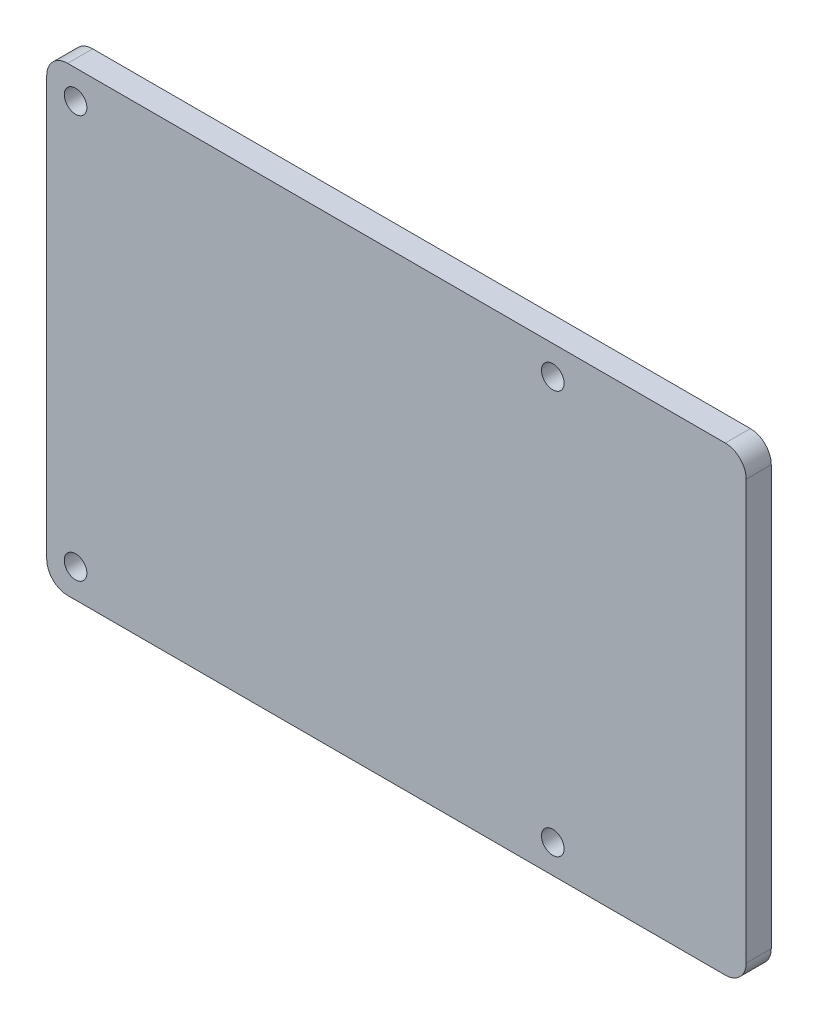
ISO-10303-21;
HEADER;
FILE_DESCRIPTION(('STEP AP214'),'2;1');
FILE_NAME('part.step','',(''),(''),'','','');
FILE_SCHEMA(('AUTOMOTIVE_DESIGN { 1 0 10303 214 1 1 1 1 }'));
ENDSEC;
DATA;
#1=APPLICATION_CONTEXT('core data for automotive mechanical design processes');
#2=APPLICATION_PROTOCOL_DEFINITION('international standard','automotive_design',2000,#1);
#3=PRODUCT_CONTEXT('',#1,'mechanical');
#4=PRODUCT('Part','Part','',(#3));
#5=PRODUCT_RELATED_PRODUCT_CATEGORY('part','',(#4));
#6=PRODUCT_DEFINITION_FORMATION('','',#4);
#7=PRODUCT_DEFINITION_CONTEXT('part definition',#1,'design');
#8=PRODUCT_DEFINITION('design','',#6,#7);
#9=PRODUCT_DEFINITION_SHAPE('','',#8);
#10=(LENGTH_UNIT() NAMED_UNIT(*) SI_UNIT(.MILLI.,.METRE.));
#11=(NAMED_UNIT(*) PLANE_ANGLE_UNIT() SI_UNIT($,.RADIAN.));
#12=(NAMED_UNIT(*) SI_UNIT($,.STERADIAN.) SOLID_ANGLE_UNIT());
#13=UNCERTAINTY_MEASURE_WITH_UNIT(LENGTH_MEASURE(1.E-05),#10,'distance_accuracy_value','');
#14=(GEOMETRIC_REPRESENTATION_CONTEXT(3) GLOBAL_UNCERTAINTY_ASSIGNED_CONTEXT((#13)) GLOBAL_UNIT_ASSIGNED_CONTEXT((#10,
#11,#12)) REPRESENTATION_CONTEXT('',''));
#15=CARTESIAN_POINT('',(0.,0.,0.));
#16=DIRECTION('',(0.,0.,1.));
#17=DIRECTION('',(1.,0.,0.));
#18=AXIS2_PLACEMENT_3D('',#15,#16,#17);
#19=CARTESIAN_POINT('',(80.3396386598597,12.48963974,-3.048));
#20=DIRECTION('',(0.,0.,1.));
#21=DIRECTION('',(1.,0.,0.));
#22=AXIS2_PLACEMENT_3D('',#19,#20,#21);
#23=CYLINDRICAL_SURFACE('',#22,2.54);
#24=CARTESIAN_POINT('',(80.3396386598597,12.48963974,0.));
#25=DIRECTION('',(0.,0.,1.));
#26=DIRECTION('',(-1.,0.,0.));
#27=AXIS2_PLACEMENT_3D('',#24,#25,#26);
#28=CIRCLE('',#27,2.54);
#29=CARTESIAN_POINT('',(82.8796386598597,12.48963974,0.));
#30=VERTEX_POINT('',#29);
#31=CARTESIAN_POINT('',(80.3396386598597,15.02963974,0.));
#32=VERTEX_POINT('',#31);
#33=EDGE_CURVE('E129',#30,#32,#28,.T.);
#34=ORIENTED_EDGE('',*,*,#33,.F.);
#35=DIRECTION('',(0.,0.,1.));
#36=VECTOR('',#35,1.);
#37=CARTESIAN_POINT('',(82.8796386598597,12.48963974,-3.048));
#38=LINE('',#37,#36);
#39=CARTESIAN_POINT('',(82.8796386598597,12.48963974,-3.048));
#40=VERTEX_POINT('',#39);
#41=EDGE_CURVE('E11',#40,#30,#38,.T.);
#42=ORIENTED_EDGE('',*,*,#41,.F.);
#43=CARTESIAN_POINT('',(80.3396386598597,12.48963974,-3.048));
#44=DIRECTION('',(0.,0.,1.));
#45=DIRECTION('',(-1.,0.,0.));
#46=AXIS2_PLACEMENT_3D('',#43,#44,#45);
#47=CIRCLE('',#46,2.54);
#48=CARTESIAN_POINT('',(80.3396386598597,15.02963974,-3.048));
#49=VERTEX_POINT('',#48);
#50=EDGE_CURVE('E150',#40,#49,#47,.T.);
#51=ORIENTED_EDGE('',*,*,#50,.T.);
#52=DIRECTION('',(0.,0.,1.));
#53=VECTOR('',#52,1.);
#54=CARTESIAN_POINT('',(80.3396386598597,15.02963974,-3.048));
#55=LINE('',#54,#53);
#56=EDGE_CURVE('E35',#49,#32,#55,.T.);
#57=ORIENTED_EDGE('',*,*,#56,.T.);
#58=EDGE_LOOP('',(#34,#42,#51,#57));
#59=FACE_BOUND('',#58,.T.);
#60=ADVANCED_FACE('F32',(#59),#23,.T.);
#61=CARTESIAN_POINT('',(82.8796386598597,12.48963974,-3.048));
#62=DIRECTION('',(1.,0.,0.));
#63=DIRECTION('',(0.,1.,0.));
#64=AXIS2_PLACEMENT_3D('',#61,#62,#63);
#65=PLANE('',#64);
#66=DIRECTION('',(0.,1.,0.));
#67=VECTOR('',#66,1.);
#68=CARTESIAN_POINT('',(82.8796386598597,12.48963974,0.));
#69=LINE('',#68,#67);
#70=CARTESIAN_POINT('',(82.8796386598597,-38.4396361,0.));
#71=VERTEX_POINT('',#70);
#72=EDGE_CURVE('E148',#71,#30,#69,.T.);
#73=ORIENTED_EDGE('',*,*,#72,.F.);
#74=DIRECTION('',(0.,0.,1.));
#75=VECTOR('',#74,1.);
#76=CARTESIAN_POINT('',(82.8796386598597,-38.4396361,-3.048));
#77=LINE('',#76,#75);
#78=CARTESIAN_POINT('',(82.8796386598597,-38.4396361,-3.048));
#79=VERTEX_POINT('',#78);
#80=EDGE_CURVE('E41',#79,#71,#77,.T.);
#81=ORIENTED_EDGE('',*,*,#80,.F.);
#82=DIRECTION('',(0.,1.,0.));
#83=VECTOR('',#82,1.);
#84=CARTESIAN_POINT('',(82.8796386598597,12.48963974,-3.048));
#85=LINE('',#84,#83);
#86=EDGE_CURVE('E119',#79,#40,#85,.T.);
#87=ORIENTED_EDGE('',*,*,#86,.T.);
#88=ORIENTED_EDGE('',*,*,#41,.T.);
#89=EDGE_LOOP('',(#73,#81,#87,#88));
#90=FACE_BOUND('',#89,.T.);
#91=ADVANCED_FACE('F162',(#90),#65,.T.);
#92=CARTESIAN_POINT('',(80.3396386598597,-38.4396361,-3.048));
#93=DIRECTION('',(0.,0.,1.));
#94=DIRECTION('',(1.,0.,0.));
#95=AXIS2_PLACEMENT_3D('',#92,#93,#94);
#96=CYLINDRICAL_SURFACE('',#95,2.54);
#97=CARTESIAN_POINT('',(80.3396386598597,-38.4396361,0.));
#98=DIRECTION('',(0.,0.,1.));
#99=DIRECTION('',(-1.,0.,0.));
#100=AXIS2_PLACEMENT_3D('',#97,#98,#99);
#101=CIRCLE('',#100,2.54);
#102=CARTESIAN_POINT('',(80.3396386598597,-40.9796361,0.));
#103=VERTEX_POINT('',#102);
#104=EDGE_CURVE('E106',#103,#71,#101,.T.);
#105=ORIENTED_EDGE('',*,*,#104,.F.);
#106=DIRECTION('',(0.,0.,1.));
#107=VECTOR('',#106,1.);
#108=CARTESIAN_POINT('',(80.3396386598597,-40.9796361,-3.048));
#109=LINE('',#108,#107);
#110=CARTESIAN_POINT('',(80.3396386598597,-40.9796361,-3.048));
#111=VERTEX_POINT('',#110);
#112=EDGE_CURVE('E101',#111,#103,#109,.T.);
#113=ORIENTED_EDGE('',*,*,#112,.F.);
#114=CARTESIAN_POINT('',(80.3396386598597,-38.4396361,-3.048));
#115=DIRECTION('',(0.,0.,1.));
#116=DIRECTION('',(-1.,0.,0.));
#117=AXIS2_PLACEMENT_3D('',#114,#115,#116);
#118=CIRCLE('',#117,2.54);
#119=EDGE_CURVE('E104',#111,#79,#118,.T.);
#120=ORIENTED_EDGE('',*,*,#119,.T.);
#121=ORIENTED_EDGE('',*,*,#80,.T.);
#122=EDGE_LOOP('',(#105,#113,#120,#121));
#123=FACE_BOUND('',#122,.T.);
#124=ADVANCED_FACE('F103',(#123),#96,.T.);
#125=CARTESIAN_POINT('',(0.41036367000002,-40.9796361,-3.048));
#126=DIRECTION('',(0.,-1.,0.));
#127=DIRECTION('',(0.,0.,-1.));
#128=AXIS2_PLACEMENT_3D('',#125,#126,#127);
#129=PLANE('',#128);
#130=DIRECTION('',(1.,0.,0.));
#131=VECTOR('',#130,1.);
#132=CARTESIAN_POINT('',(0.41036367000002,-40.9796361,0.));
#133=LINE('',#132,#131);
#134=CARTESIAN_POINT('',(0.410363670000021,-40.9796361,0.));
#135=VERTEX_POINT('',#134);
#136=EDGE_CURVE('E145',#135,#103,#133,.T.);
#137=ORIENTED_EDGE('',*,*,#136,.F.);
#138=DIRECTION('',(0.,0.,1.));
#139=VECTOR('',#138,1.);
#140=CARTESIAN_POINT('',(0.410363670000021,-40.9796361,-3.048));
#141=LINE('',#140,#139);
#142=CARTESIAN_POINT('',(0.410363670000021,-40.9796361,-3.048));
#143=VERTEX_POINT('',#142);
#144=EDGE_CURVE('E111',#143,#135,#141,.T.);
#145=ORIENTED_EDGE('',*,*,#144,.F.);
#146=DIRECTION('',(1.,0.,0.));
#147=VECTOR('',#146,1.);
#148=CARTESIAN_POINT('',(0.41036367000002,-40.9796361,-3.048));
#149=LINE('',#148,#147);
#150=EDGE_CURVE('E117',#143,#111,#149,.T.);
#151=ORIENTED_EDGE('',*,*,#150,.T.);
#152=ORIENTED_EDGE('',*,*,#112,.T.);
#153=EDGE_LOOP('',(#137,#145,#151,#152));
#154=FACE_BOUND('',#153,.T.);
#155=ADVANCED_FACE('F121',(#154),#129,.T.);
#156=CARTESIAN_POINT('',(0.410363670000002,-38.4396361,-3.048));
#157=DIRECTION('',(0.,0.,1.));
#158=DIRECTION('',(1.,0.,0.));
#159=AXIS2_PLACEMENT_3D('',#156,#157,#158);
#160=CYLINDRICAL_SURFACE('',#159,2.54);
#161=CARTESIAN_POINT('',(0.410363670000002,-38.4396361,0.));
#162=DIRECTION('',(0.,0.,1.));
#163=DIRECTION('',(-1.,0.,0.));
#164=AXIS2_PLACEMENT_3D('',#161,#162,#163);
#165=CIRCLE('',#164,2.54);
#166=CARTESIAN_POINT('',(-2.12963633,-38.4396361,0.));
#167=VERTEX_POINT('',#166);
#168=EDGE_CURVE('E142',#167,#135,#165,.T.);
#169=ORIENTED_EDGE('',*,*,#168,.F.);
#170=DIRECTION('',(0.,0.,1.));
#171=VECTOR('',#170,1.);
#172=CARTESIAN_POINT('',(-2.12963633,-38.4396361,-3.048));
#173=LINE('',#172,#171);
#174=CARTESIAN_POINT('',(-2.12963633,-38.4396361,-3.048));
#175=VERTEX_POINT('',#174);
#176=EDGE_CURVE('E154',#175,#167,#173,.T.);
#177=ORIENTED_EDGE('',*,*,#176,.F.);
#178=CARTESIAN_POINT('',(0.410363670000002,-38.4396361,-3.048));
#179=DIRECTION('',(0.,0.,1.));
#180=DIRECTION('',(-1.,0.,0.));
#181=AXIS2_PLACEMENT_3D('',#178,#179,#180);
#182=CIRCLE('',#181,2.54);
#183=EDGE_CURVE('E122',#175,#143,#182,.T.);
#184=ORIENTED_EDGE('',*,*,#183,.T.);
#185=ORIENTED_EDGE('',*,*,#144,.T.);
#186=EDGE_LOOP('',(#169,#177,#184,#185));
#187=FACE_BOUND('',#186,.T.);
#188=ADVANCED_FACE('F175',(#187),#160,.T.);
#189=CARTESIAN_POINT('',(-2.12963633,12.48963974,-3.048));
#190=DIRECTION('',(-1.,0.,0.));
#191=DIRECTION('',(0.,0.,1.));
#192=AXIS2_PLACEMENT_3D('',#189,#190,#191);
#193=PLANE('',#192);
#194=DIRECTION('',(0.,-1.,0.));
#195=VECTOR('',#194,1.);
#196=CARTESIAN_POINT('',(-2.12963633,12.48963974,0.));
#197=LINE('',#196,#195);
#198=CARTESIAN_POINT('',(-2.12963633,12.48963974,0.));
#199=VERTEX_POINT('',#198);
#200=EDGE_CURVE('E139',#199,#167,#197,.T.);
#201=ORIENTED_EDGE('',*,*,#200,.F.);
#202=DIRECTION('',(0.,0.,1.));
#203=VECTOR('',#202,1.);
#204=CARTESIAN_POINT('',(-2.12963633,12.48963974,-3.048));
#205=LINE('',#204,#203);
#206=CARTESIAN_POINT('',(-2.12963633,12.48963974,-3.048));
#207=VERTEX_POINT('',#206);
#208=EDGE_CURVE('E156',#207,#199,#205,.T.);
#209=ORIENTED_EDGE('',*,*,#208,.F.);
#210=DIRECTION('',(0.,-1.,0.));
#211=VECTOR('',#210,1.);
#212=CARTESIAN_POINT('',(-2.12963633,12.48963974,-3.048));
#213=LINE('',#212,#211);
#214=EDGE_CURVE('E124',#207,#175,#213,.T.);
#215=ORIENTED_EDGE('',*,*,#214,.T.);
#216=ORIENTED_EDGE('',*,*,#176,.T.);
#217=EDGE_LOOP('',(#201,#209,#215,#216));
#218=FACE_BOUND('',#217,.T.);
#219=ADVANCED_FACE('F178',(#218),#193,.T.);
#220=CARTESIAN_POINT('',(0.410363670000002,12.48963974,-3.048));
#221=DIRECTION('',(0.,0.,1.));
#222=DIRECTION('',(1.,0.,0.));
#223=AXIS2_PLACEMENT_3D('',#220,#221,#222);
#224=CYLINDRICAL_SURFACE('',#223,2.54);
#225=CARTESIAN_POINT('',(0.410363670000002,12.48963974,0.));
#226=DIRECTION('',(0.,0.,1.));
#227=DIRECTION('',(-1.,0.,0.));
#228=AXIS2_PLACEMENT_3D('',#225,#226,#227);
#229=CIRCLE('',#228,2.54);
#230=CARTESIAN_POINT('',(0.41036367000002,15.02963974,0.));
#231=VERTEX_POINT('',#230);
#232=EDGE_CURVE('E136',#231,#199,#229,.T.);
#233=ORIENTED_EDGE('',*,*,#232,.F.);
#234=DIRECTION('',(0.,0.,1.));
#235=VECTOR('',#234,1.);
#236=CARTESIAN_POINT('',(0.41036367000002,15.02963974,-3.048));
#237=LINE('',#236,#235);
#238=CARTESIAN_POINT('',(0.41036367000002,15.02963974,-3.048));
#239=VERTEX_POINT('',#238);
#240=EDGE_CURVE('E157',#239,#231,#237,.T.);
#241=ORIENTED_EDGE('',*,*,#240,.F.);
#242=CARTESIAN_POINT('',(0.410363670000002,12.48963974,-3.048));
#243=DIRECTION('',(0.,0.,1.));
#244=DIRECTION('',(-1.,0.,0.));
#245=AXIS2_PLACEMENT_3D('',#242,#243,#244);
#246=CIRCLE('',#245,2.54);
#247=EDGE_CURVE('E244',#239,#207,#246,.T.);
#248=ORIENTED_EDGE('',*,*,#247,.T.);
#249=ORIENTED_EDGE('',*,*,#208,.T.);
#250=EDGE_LOOP('',(#233,#241,#248,#249));
#251=FACE_BOUND('',#250,.T.);
#252=ADVANCED_FACE('F182',(#251),#224,.T.);
#253=CARTESIAN_POINT('',(0.41036367000002,15.02963974,-3.048));
#254=DIRECTION('',(0.,1.,0.));
#255=DIRECTION('',(-1.,0.,0.));
#256=AXIS2_PLACEMENT_3D('',#253,#254,#255);
#257=PLANE('',#256);
#258=DIRECTION('',(-1.,0.,0.));
#259=VECTOR('',#258,1.);
#260=CARTESIAN_POINT('',(0.41036367000002,15.02963974,0.));
#261=LINE('',#260,#259);
#262=EDGE_CURVE('E132',#32,#231,#261,.T.);
#263=ORIENTED_EDGE('',*,*,#262,.F.);
#264=ORIENTED_EDGE('',*,*,#56,.F.);
#265=DIRECTION('',(-1.,0.,0.));
#266=VECTOR('',#265,1.);
#267=CARTESIAN_POINT('',(0.41036367000002,15.02963974,-3.048));
#268=LINE('',#267,#266);
#269=EDGE_CURVE('E242',#49,#239,#268,.T.);
#270=ORIENTED_EDGE('',*,*,#269,.T.);
#271=ORIENTED_EDGE('',*,*,#240,.T.);
#272=EDGE_LOOP('',(#263,#264,#270,#271));
#273=FACE_BOUND('',#272,.T.);
#274=ADVANCED_FACE('F159',(#273),#257,.T.);
#275=CARTESIAN_POINT('',(80.3396386598597,12.48963974,-3.048));
#276=DIRECTION('',(0.,0.,-1.));
#277=DIRECTION('',(-1.,0.,0.));
#278=AXIS2_PLACEMENT_3D('',#275,#276,#277);
#279=PLANE('',#278);
#280=CARTESIAN_POINT('',(1.37500106,-37.47499998,-3.048));
#281=DIRECTION('',(0.,0.,1.));
#282=DIRECTION('',(1.,0.,0.));
#283=AXIS2_PLACEMENT_3D('',#280,#281,#282);
#284=CIRCLE('',#283,1.37499852);
#285=CARTESIAN_POINT('',(2.74999958,-37.47499998,-3.048));
#286=VERTEX_POINT('',#285);
#287=EDGE_CURVE('E217',#286,#286,#284,.T.);
#288=ORIENTED_EDGE('',*,*,#287,.T.);
#289=EDGE_LOOP('',(#288));
#290=FACE_BOUND('',#289,.T.);
#291=CARTESIAN_POINT('',(59.3750019,-37.47499998,-3.048));
#292=DIRECTION('',(0.,0.,1.));
#293=DIRECTION('',(1.,0.,0.));
#294=AXIS2_PLACEMENT_3D('',#291,#292,#293);
#295=CIRCLE('',#294,1.37499852);
#296=CARTESIAN_POINT('',(60.75000042,-37.47499998,-3.048));
#297=VERTEX_POINT('',#296);
#298=EDGE_CURVE('E225',#297,#297,#295,.T.);
#299=ORIENTED_EDGE('',*,*,#298,.T.);
#300=EDGE_LOOP('',(#299));
#301=FACE_BOUND('',#300,.T.);
#302=CARTESIAN_POINT('',(59.3750019,11.52500108,-3.048));
#303=DIRECTION('',(0.,0.,1.));
#304=DIRECTION('',(1.,0.,0.));
#305=AXIS2_PLACEMENT_3D('',#302,#303,#304);
#306=CIRCLE('',#305,1.37499852);
#307=CARTESIAN_POINT('',(60.75000042,11.52500108,-3.048));
#308=VERTEX_POINT('',#307);
#309=EDGE_CURVE('E231',#308,#308,#306,.T.);
#310=ORIENTED_EDGE('',*,*,#309,.T.);
#311=EDGE_LOOP('',(#310));
#312=FACE_BOUND('',#311,.T.);
#313=CARTESIAN_POINT('',(1.37500106,11.52500108,-3.048));
#314=DIRECTION('',(0.,0.,1.));
#315=DIRECTION('',(1.,0.,0.));
#316=AXIS2_PLACEMENT_3D('',#313,#314,#315);
#317=CIRCLE('',#316,1.37499852);
#318=CARTESIAN_POINT('',(2.74999958,11.52500108,-3.048));
#319=VERTEX_POINT('',#318);
#320=EDGE_CURVE('E133',#319,#319,#317,.T.);
#321=ORIENTED_EDGE('',*,*,#320,.T.);
#322=EDGE_LOOP('',(#321));
#323=FACE_BOUND('',#322,.T.);
#324=ORIENTED_EDGE('',*,*,#50,.F.);
#325=ORIENTED_EDGE('',*,*,#86,.F.);
#326=ORIENTED_EDGE('',*,*,#119,.F.);
#327=ORIENTED_EDGE('',*,*,#150,.F.);
#328=ORIENTED_EDGE('',*,*,#183,.F.);
#329=ORIENTED_EDGE('',*,*,#214,.F.);
#330=ORIENTED_EDGE('',*,*,#247,.F.);
#331=ORIENTED_EDGE('',*,*,#269,.F.);
#332=EDGE_LOOP('',(#324,#325,#326,#327,#328,#329,#330,#331));
#333=FACE_BOUND('',#332,.T.);
#334=ADVANCED_FACE('F115',(#290,#301,#312,#323,#333),#279,.T.);
#335=CARTESIAN_POINT('',(80.3396386598597,12.48963974,0.));
#336=DIRECTION('',(0.,0.,-1.));
#337=DIRECTION('',(-1.,0.,0.));
#338=AXIS2_PLACEMENT_3D('',#335,#336,#337);
#339=PLANE('',#338);
#340=CARTESIAN_POINT('',(1.37500106,-37.47499998,0.));
#341=DIRECTION('',(0.,0.,1.));
#342=DIRECTION('',(1.,0.,0.));
#343=AXIS2_PLACEMENT_3D('',#340,#341,#342);
#344=CIRCLE('',#343,1.37499852);
#345=CARTESIAN_POINT('',(2.74999958,-37.47499998,0.));
#346=VERTEX_POINT('',#345);
#347=EDGE_CURVE('E220',#346,#346,#344,.T.);
#348=ORIENTED_EDGE('',*,*,#347,.F.);
#349=EDGE_LOOP('',(#348));
#350=FACE_BOUND('',#349,.T.);
#351=CARTESIAN_POINT('',(59.3750019,-37.47499998,0.));
#352=DIRECTION('',(0.,0.,1.));
#353=DIRECTION('',(1.,0.,0.));
#354=AXIS2_PLACEMENT_3D('',#351,#352,#353);
#355=CIRCLE('',#354,1.37499852);
#356=CARTESIAN_POINT('',(60.75000042,-37.47499998,0.));
#357=VERTEX_POINT('',#356);
#358=EDGE_CURVE('E222',#357,#357,#355,.T.);
#359=ORIENTED_EDGE('',*,*,#358,.F.);
#360=EDGE_LOOP('',(#359));
#361=FACE_BOUND('',#360,.T.);
#362=CARTESIAN_POINT('',(59.3750019,11.52500108,0.));
#363=DIRECTION('',(0.,0.,1.));
#364=DIRECTION('',(1.,0.,0.));
#365=AXIS2_PLACEMENT_3D('',#362,#363,#364);
#366=CIRCLE('',#365,1.37499852);
#367=CARTESIAN_POINT('',(60.75000042,11.52500108,0.));
#368=VERTEX_POINT('',#367);
#369=EDGE_CURVE('E228',#368,#368,#366,.T.);
#370=ORIENTED_EDGE('',*,*,#369,.F.);
#371=EDGE_LOOP('',(#370));
#372=FACE_BOUND('',#371,.T.);
#373=CARTESIAN_POINT('',(1.37500106,11.52500108,0.));
#374=DIRECTION('',(0.,0.,1.));
#375=DIRECTION('',(1.,0.,0.));
#376=AXIS2_PLACEMENT_3D('',#373,#374,#375);
#377=CIRCLE('',#376,1.37499852);
#378=CARTESIAN_POINT('',(2.74999958,11.52500108,0.));
#379=VERTEX_POINT('',#378);
#380=EDGE_CURVE('E234',#379,#379,#377,.T.);
#381=ORIENTED_EDGE('',*,*,#380,.F.);
#382=EDGE_LOOP('',(#381));
#383=FACE_BOUND('',#382,.T.);
#384=ORIENTED_EDGE('',*,*,#33,.T.);
#385=ORIENTED_EDGE('',*,*,#262,.T.);
#386=ORIENTED_EDGE('',*,*,#232,.T.);
#387=ORIENTED_EDGE('',*,*,#200,.T.);
#388=ORIENTED_EDGE('',*,*,#168,.T.);
#389=ORIENTED_EDGE('',*,*,#136,.T.);
#390=ORIENTED_EDGE('',*,*,#104,.T.);
#391=ORIENTED_EDGE('',*,*,#72,.T.);
#392=EDGE_LOOP('',(#384,#385,#386,#387,#388,#389,#390,#391));
#393=FACE_BOUND('',#392,.T.);
#394=ADVANCED_FACE('F161',(#350,#361,#372,#383,#393),#339,.F.);
#395=CARTESIAN_POINT('',(1.37500106,11.52500108,-3.048));
#396=DIRECTION('',(0.,0.,1.));
#397=DIRECTION('',(1.,0.,0.));
#398=AXIS2_PLACEMENT_3D('',#395,#396,#397);
#399=CYLINDRICAL_SURFACE('',#398,1.37499852);
#400=ORIENTED_EDGE('',*,*,#320,.F.);
#401=EDGE_LOOP('',(#400));
#402=FACE_BOUND('',#401,.T.);
#403=ORIENTED_EDGE('',*,*,#380,.T.);
#404=EDGE_LOOP('',(#403));
#405=FACE_BOUND('',#404,.T.);
#406=ADVANCED_FACE('F194',(#402,#405),#399,.F.);
#407=CARTESIAN_POINT('',(59.3750019,11.52500108,-3.048));
#408=DIRECTION('',(0.,0.,1.));
#409=DIRECTION('',(1.,0.,0.));
#410=AXIS2_PLACEMENT_3D('',#407,#408,#409);
#411=CYLINDRICAL_SURFACE('',#410,1.37499852);
#412=ORIENTED_EDGE('',*,*,#309,.F.);
#413=EDGE_LOOP('',(#412));
#414=FACE_BOUND('',#413,.T.);
#415=ORIENTED_EDGE('',*,*,#369,.T.);
#416=EDGE_LOOP('',(#415));
#417=FACE_BOUND('',#416,.T.);
#418=ADVANCED_FACE('F201',(#414,#417),#411,.F.);
#419=CARTESIAN_POINT('',(59.3750019,-37.47499998,-3.048));
#420=DIRECTION('',(0.,0.,1.));
#421=DIRECTION('',(1.,0.,0.));
#422=AXIS2_PLACEMENT_3D('',#419,#420,#421);
#423=CYLINDRICAL_SURFACE('',#422,1.37499852);
#424=ORIENTED_EDGE('',*,*,#298,.F.);
#425=EDGE_LOOP('',(#424));
#426=FACE_BOUND('',#425,.T.);
#427=ORIENTED_EDGE('',*,*,#358,.T.);
#428=EDGE_LOOP('',(#427));
#429=FACE_BOUND('',#428,.T.);
#430=ADVANCED_FACE('F205',(#426,#429),#423,.F.);
#431=CARTESIAN_POINT('',(1.37500106,-37.47499998,-3.048));
#432=DIRECTION('',(0.,0.,1.));
#433=DIRECTION('',(1.,0.,0.));
#434=AXIS2_PLACEMENT_3D('',#431,#432,#433);
#435=CYLINDRICAL_SURFACE('',#434,1.37499852);
#436=ORIENTED_EDGE('',*,*,#287,.F.);
#437=EDGE_LOOP('',(#436));
#438=FACE_BOUND('',#437,.T.);
#439=ORIENTED_EDGE('',*,*,#347,.T.);
#440=EDGE_LOOP('',(#439));
#441=FACE_BOUND('',#440,.T.);
#442=ADVANCED_FACE('F209',(#438,#441),#435,.F.);
#443=CLOSED_SHELL('',(#60,#91,#124,#155,#188,#219,#252,#274,#334,#394,#406,#418,#430,#442));
#444=MANIFOLD_SOLID_BREP('B2',#443);
#445=ADVANCED_BREP_SHAPE_REPRESENTATION('',(#18,#444),#14);
#446=SHAPE_DEFINITION_REPRESENTATION(#9,#445);
ENDSEC;
END-ISO-10303-21;
